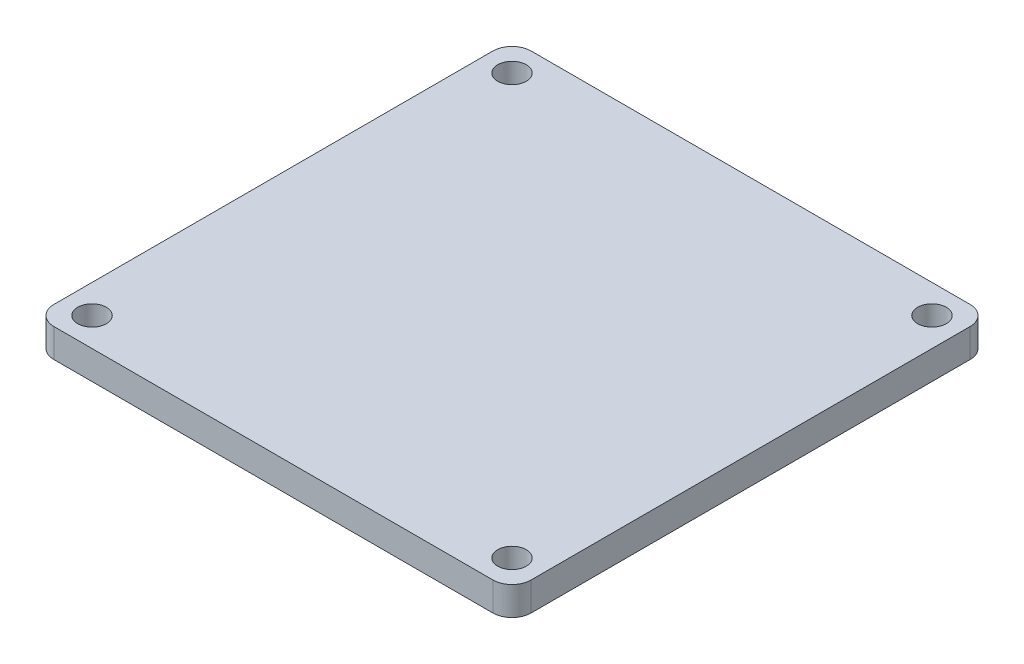
ISO-10303-21;
HEADER;
FILE_DESCRIPTION(('STEP AP214'),'2;1');
FILE_NAME('part.step','',(''),(''),'','','');
FILE_SCHEMA(('AUTOMOTIVE_DESIGN { 1 0 10303 214 1 1 1 1 }'));
ENDSEC;
DATA;
#1=APPLICATION_CONTEXT('core data for automotive mechanical design processes');
#2=APPLICATION_PROTOCOL_DEFINITION('international standard','automotive_design',2000,#1);
#3=PRODUCT_CONTEXT('',#1,'mechanical');
#4=PRODUCT('Part','Part','',(#3));
#5=PRODUCT_RELATED_PRODUCT_CATEGORY('part','',(#4));
#6=PRODUCT_DEFINITION_FORMATION('','',#4);
#7=PRODUCT_DEFINITION_CONTEXT('part definition',#1,'design');
#8=PRODUCT_DEFINITION('design','',#6,#7);
#9=PRODUCT_DEFINITION_SHAPE('','',#8);
#10=(LENGTH_UNIT() NAMED_UNIT(*) SI_UNIT(.MILLI.,.METRE.));
#11=(NAMED_UNIT(*) PLANE_ANGLE_UNIT() SI_UNIT($,.RADIAN.));
#12=(NAMED_UNIT(*) SI_UNIT($,.STERADIAN.) SOLID_ANGLE_UNIT());
#13=UNCERTAINTY_MEASURE_WITH_UNIT(LENGTH_MEASURE(1.E-05),#10,'distance_accuracy_value','');
#14=(GEOMETRIC_REPRESENTATION_CONTEXT(3) GLOBAL_UNCERTAINTY_ASSIGNED_CONTEXT((#13)) GLOBAL_UNIT_ASSIGNED_CONTEXT((#10,
#11,#12)) REPRESENTATION_CONTEXT('',''));
#15=CARTESIAN_POINT('',(0.,0.,0.));
#16=DIRECTION('',(0.,0.,1.));
#17=DIRECTION('',(1.,0.,0.));
#18=AXIS2_PLACEMENT_3D('',#15,#16,#17);
#19=CARTESIAN_POINT('',(-23.,3.,23.));
#20=DIRECTION('',(0.,-1.,0.));
#21=DIRECTION('',(0.,0.,-1.));
#22=AXIS2_PLACEMENT_3D('',#19,#20,#21);
#23=PLANE('',#22);
#24=CARTESIAN_POINT('',(-23.,3.,23.));
#25=DIRECTION('',(0.,1.,0.));
#26=DIRECTION('',(0.,0.,-1.));
#27=AXIS2_PLACEMENT_3D('',#24,#25,#26);
#28=CIRCLE('',#27,2.);
#29=CARTESIAN_POINT('',(-25.,3.,23.));
#30=VERTEX_POINT('',#29);
#31=CARTESIAN_POINT('',(-23.,3.,25.));
#32=VERTEX_POINT('',#31);
#33=EDGE_CURVE('E164',#30,#32,#28,.T.);
#34=ORIENTED_EDGE('',*,*,#33,.T.);
#35=DIRECTION('',(1.,0.,0.));
#36=VECTOR('',#35,1.);
#37=CARTESIAN_POINT('',(23.,3.,25.));
#38=LINE('',#37,#36);
#39=CARTESIAN_POINT('',(23.,3.,25.));
#40=VERTEX_POINT('',#39);
#41=EDGE_CURVE('E100',#32,#40,#38,.T.);
#42=ORIENTED_EDGE('',*,*,#41,.T.);
#43=CARTESIAN_POINT('',(23.,3.,23.));
#44=DIRECTION('',(0.,1.,0.));
#45=DIRECTION('',(0.,0.,-1.));
#46=AXIS2_PLACEMENT_3D('',#43,#44,#45);
#47=CIRCLE('',#46,2.);
#48=CARTESIAN_POINT('',(25.,3.,23.));
#49=VERTEX_POINT('',#48);
#50=EDGE_CURVE('E185',#40,#49,#47,.T.);
#51=ORIENTED_EDGE('',*,*,#50,.T.);
#52=DIRECTION('',(0.,0.,-1.));
#53=VECTOR('',#52,1.);
#54=CARTESIAN_POINT('',(25.,3.,-23.));
#55=LINE('',#54,#53);
#56=CARTESIAN_POINT('',(25.,3.,-23.));
#57=VERTEX_POINT('',#56);
#58=EDGE_CURVE('E199',#49,#57,#55,.T.);
#59=ORIENTED_EDGE('',*,*,#58,.T.);
#60=CARTESIAN_POINT('',(23.,3.,-23.));
#61=DIRECTION('',(0.,1.,0.));
#62=DIRECTION('',(0.,0.,-1.));
#63=AXIS2_PLACEMENT_3D('',#60,#61,#62);
#64=CIRCLE('',#63,2.);
#65=CARTESIAN_POINT('',(23.,3.,-25.));
#66=VERTEX_POINT('',#65);
#67=EDGE_CURVE('E119',#57,#66,#64,.T.);
#68=ORIENTED_EDGE('',*,*,#67,.T.);
#69=DIRECTION('',(-1.,0.,0.));
#70=VECTOR('',#69,1.);
#71=CARTESIAN_POINT('',(23.,3.,-25.));
#72=LINE('',#71,#70);
#73=CARTESIAN_POINT('',(-23.,3.,-25.));
#74=VERTEX_POINT('',#73);
#75=EDGE_CURVE('E113',#66,#74,#72,.T.);
#76=ORIENTED_EDGE('',*,*,#75,.T.);
#77=CARTESIAN_POINT('',(-23.,3.,-23.));
#78=DIRECTION('',(0.,1.,0.));
#79=DIRECTION('',(0.,0.,1.));
#80=AXIS2_PLACEMENT_3D('',#77,#78,#79);
#81=CIRCLE('',#80,2.);
#82=CARTESIAN_POINT('',(-25.,3.,-23.));
#83=VERTEX_POINT('',#82);
#84=EDGE_CURVE('E117',#74,#83,#81,.T.);
#85=ORIENTED_EDGE('',*,*,#84,.T.);
#86=DIRECTION('',(0.,0.,1.));
#87=VECTOR('',#86,1.);
#88=CARTESIAN_POINT('',(-25.,3.,-23.));
#89=LINE('',#88,#87);
#90=EDGE_CURVE('E57',#83,#30,#89,.T.);
#91=ORIENTED_EDGE('',*,*,#90,.T.);
#92=EDGE_LOOP('',(#34,#42,#51,#59,#68,#76,#85,#91));
#93=FACE_BOUND('',#92,.T.);
#94=CARTESIAN_POINT('',(22.,3.,-22.));
#95=DIRECTION('',(0.,1.,0.));
#96=DIRECTION('',(0.,0.,1.));
#97=AXIS2_PLACEMENT_3D('',#94,#95,#96);
#98=CIRCLE('',#97,1.5);
#99=CARTESIAN_POINT('',(22.,3.,-20.5));
#100=VERTEX_POINT('',#99);
#101=EDGE_CURVE('E146',#100,#100,#98,.T.);
#102=ORIENTED_EDGE('',*,*,#101,.F.);
#103=EDGE_LOOP('',(#102));
#104=FACE_BOUND('',#103,.T.);
#105=CARTESIAN_POINT('',(22.,3.,22.));
#106=DIRECTION('',(0.,1.,0.));
#107=DIRECTION('',(0.,0.,1.));
#108=AXIS2_PLACEMENT_3D('',#105,#106,#107);
#109=CIRCLE('',#108,1.5);
#110=CARTESIAN_POINT('',(22.,3.,23.5));
#111=VERTEX_POINT('',#110);
#112=EDGE_CURVE('E213',#111,#111,#109,.T.);
#113=ORIENTED_EDGE('',*,*,#112,.F.);
#114=EDGE_LOOP('',(#113));
#115=FACE_BOUND('',#114,.T.);
#116=CARTESIAN_POINT('',(-22.,3.,-22.));
#117=DIRECTION('',(0.,1.,0.));
#118=DIRECTION('',(0.,0.,-1.));
#119=AXIS2_PLACEMENT_3D('',#116,#117,#118);
#120=CIRCLE('',#119,1.5);
#121=CARTESIAN_POINT('',(-22.,3.,-23.5));
#122=VERTEX_POINT('',#121);
#123=EDGE_CURVE('E221',#122,#122,#120,.T.);
#124=ORIENTED_EDGE('',*,*,#123,.F.);
#125=EDGE_LOOP('',(#124));
#126=FACE_BOUND('',#125,.T.);
#127=CARTESIAN_POINT('',(-22.,3.,22.));
#128=DIRECTION('',(0.,1.,0.));
#129=DIRECTION('',(0.,0.,-1.));
#130=AXIS2_PLACEMENT_3D('',#127,#128,#129);
#131=CIRCLE('',#130,1.5);
#132=CARTESIAN_POINT('',(-22.,3.,20.5));
#133=VERTEX_POINT('',#132);
#134=EDGE_CURVE('E229',#133,#133,#131,.T.);
#135=ORIENTED_EDGE('',*,*,#134,.F.);
#136=EDGE_LOOP('',(#135));
#137=FACE_BOUND('',#136,.T.);
#138=ADVANCED_FACE('F39',(#93,#104,#115,#126,#137),#23,.F.);
#139=CARTESIAN_POINT('',(-23.,0.,23.));
#140=DIRECTION('',(0.,-1.,0.));
#141=DIRECTION('',(0.,0.,-1.));
#142=AXIS2_PLACEMENT_3D('',#139,#140,#141);
#143=PLANE('',#142);
#144=CARTESIAN_POINT('',(-22.,0.,-22.));
#145=DIRECTION('',(0.,1.,0.));
#146=DIRECTION('',(0.,0.,-1.));
#147=AXIS2_PLACEMENT_3D('',#144,#145,#146);
#148=CIRCLE('',#147,1.5);
#149=CARTESIAN_POINT('',(-22.,0.,-23.5));
#150=VERTEX_POINT('',#149);
#151=EDGE_CURVE('E225',#150,#150,#148,.T.);
#152=ORIENTED_EDGE('',*,*,#151,.T.);
#153=EDGE_LOOP('',(#152));
#154=FACE_BOUND('',#153,.T.);
#155=CARTESIAN_POINT('',(22.,0.,-22.));
#156=DIRECTION('',(0.,1.,0.));
#157=DIRECTION('',(0.,0.,1.));
#158=AXIS2_PLACEMENT_3D('',#155,#156,#157);
#159=CIRCLE('',#158,1.5);
#160=CARTESIAN_POINT('',(22.,0.,-20.5));
#161=VERTEX_POINT('',#160);
#162=EDGE_CURVE('E209',#161,#161,#159,.T.);
#163=ORIENTED_EDGE('',*,*,#162,.T.);
#164=EDGE_LOOP('',(#163));
#165=FACE_BOUND('',#164,.T.);
#166=CARTESIAN_POINT('',(-23.,0.,23.));
#167=DIRECTION('',(0.,1.,0.));
#168=DIRECTION('',(0.,0.,-1.));
#169=AXIS2_PLACEMENT_3D('',#166,#167,#168);
#170=CIRCLE('',#169,2.);
#171=CARTESIAN_POINT('',(-25.,0.,23.));
#172=VERTEX_POINT('',#171);
#173=CARTESIAN_POINT('',(-23.,0.,25.));
#174=VERTEX_POINT('',#173);
#175=EDGE_CURVE('E141',#172,#174,#170,.T.);
#176=ORIENTED_EDGE('',*,*,#175,.F.);
#177=DIRECTION('',(0.,0.,1.));
#178=VECTOR('',#177,1.);
#179=CARTESIAN_POINT('',(-25.,0.,-23.));
#180=LINE('',#179,#178);
#181=CARTESIAN_POINT('',(-25.,0.,-23.));
#182=VERTEX_POINT('',#181);
#183=EDGE_CURVE('E92',#182,#172,#180,.T.);
#184=ORIENTED_EDGE('',*,*,#183,.F.);
#185=CARTESIAN_POINT('',(-23.,0.,-23.));
#186=DIRECTION('',(0.,1.,0.));
#187=DIRECTION('',(0.,0.,1.));
#188=AXIS2_PLACEMENT_3D('',#185,#186,#187);
#189=CIRCLE('',#188,2.);
#190=CARTESIAN_POINT('',(-23.,0.,-25.));
#191=VERTEX_POINT('',#190);
#192=EDGE_CURVE('E86',#191,#182,#189,.T.);
#193=ORIENTED_EDGE('',*,*,#192,.F.);
#194=DIRECTION('',(-1.,0.,0.));
#195=VECTOR('',#194,1.);
#196=CARTESIAN_POINT('',(23.,0.,-25.));
#197=LINE('',#196,#195);
#198=CARTESIAN_POINT('',(23.,0.,-25.));
#199=VERTEX_POINT('',#198);
#200=EDGE_CURVE('E128',#199,#191,#197,.T.);
#201=ORIENTED_EDGE('',*,*,#200,.F.);
#202=CARTESIAN_POINT('',(23.,0.,-23.));
#203=DIRECTION('',(0.,1.,0.));
#204=DIRECTION('',(0.,0.,-1.));
#205=AXIS2_PLACEMENT_3D('',#202,#203,#204);
#206=CIRCLE('',#205,2.);
#207=CARTESIAN_POINT('',(25.,0.,-23.));
#208=VERTEX_POINT('',#207);
#209=EDGE_CURVE('E155',#208,#199,#206,.T.);
#210=ORIENTED_EDGE('',*,*,#209,.F.);
#211=DIRECTION('',(0.,0.,-1.));
#212=VECTOR('',#211,1.);
#213=CARTESIAN_POINT('',(25.,0.,-23.));
#214=LINE('',#213,#212);
#215=CARTESIAN_POINT('',(25.,0.,23.));
#216=VERTEX_POINT('',#215);
#217=EDGE_CURVE('E152',#216,#208,#214,.T.);
#218=ORIENTED_EDGE('',*,*,#217,.F.);
#219=CARTESIAN_POINT('',(23.,0.,23.));
#220=DIRECTION('',(0.,1.,0.));
#221=DIRECTION('',(0.,0.,-1.));
#222=AXIS2_PLACEMENT_3D('',#219,#220,#221);
#223=CIRCLE('',#222,2.);
#224=CARTESIAN_POINT('',(23.,0.,25.));
#225=VERTEX_POINT('',#224);
#226=EDGE_CURVE('E149',#225,#216,#223,.T.);
#227=ORIENTED_EDGE('',*,*,#226,.F.);
#228=DIRECTION('',(1.,0.,0.));
#229=VECTOR('',#228,1.);
#230=CARTESIAN_POINT('',(23.,0.,25.));
#231=LINE('',#230,#229);
#232=EDGE_CURVE('E145',#174,#225,#231,.T.);
#233=ORIENTED_EDGE('',*,*,#232,.F.);
#234=EDGE_LOOP('',(#176,#184,#193,#201,#210,#218,#227,#233));
#235=FACE_BOUND('',#234,.T.);
#236=CARTESIAN_POINT('',(22.,0.,22.));
#237=DIRECTION('',(0.,1.,0.));
#238=DIRECTION('',(0.,0.,1.));
#239=AXIS2_PLACEMENT_3D('',#236,#237,#238);
#240=CIRCLE('',#239,1.5);
#241=CARTESIAN_POINT('',(22.,0.,23.5));
#242=VERTEX_POINT('',#241);
#243=EDGE_CURVE('E217',#242,#242,#240,.T.);
#244=ORIENTED_EDGE('',*,*,#243,.T.);
#245=EDGE_LOOP('',(#244));
#246=FACE_BOUND('',#245,.T.);
#247=CARTESIAN_POINT('',(-22.,0.,22.));
#248=DIRECTION('',(0.,1.,0.));
#249=DIRECTION('',(0.,0.,-1.));
#250=AXIS2_PLACEMENT_3D('',#247,#248,#249);
#251=CIRCLE('',#250,1.5);
#252=CARTESIAN_POINT('',(-22.,0.,20.5));
#253=VERTEX_POINT('',#252);
#254=EDGE_CURVE('E233',#253,#253,#251,.T.);
#255=ORIENTED_EDGE('',*,*,#254,.T.);
#256=EDGE_LOOP('',(#255));
#257=FACE_BOUND('',#256,.T.);
#258=ADVANCED_FACE('F189',(#154,#165,#235,#246,#257),#143,.T.);
#259=CARTESIAN_POINT('',(-23.,3.,23.));
#260=DIRECTION('',(0.,-1.,0.));
#261=DIRECTION('',(0.,0.,-1.));
#262=AXIS2_PLACEMENT_3D('',#259,#260,#261);
#263=CYLINDRICAL_SURFACE('',#262,2.);
#264=ORIENTED_EDGE('',*,*,#175,.T.);
#265=DIRECTION('',(0.,-1.,0.));
#266=VECTOR('',#265,1.);
#267=CARTESIAN_POINT('',(-23.,3.,25.));
#268=LINE('',#267,#266);
#269=EDGE_CURVE('E11',#32,#174,#268,.T.);
#270=ORIENTED_EDGE('',*,*,#269,.F.);
#271=ORIENTED_EDGE('',*,*,#33,.F.);
#272=DIRECTION('',(0.,-1.,0.));
#273=VECTOR('',#272,1.);
#274=CARTESIAN_POINT('',(-25.,3.,23.));
#275=LINE('',#274,#273);
#276=EDGE_CURVE('E137',#30,#172,#275,.T.);
#277=ORIENTED_EDGE('',*,*,#276,.T.);
#278=EDGE_LOOP('',(#264,#270,#271,#277));
#279=FACE_BOUND('',#278,.T.);
#280=ADVANCED_FACE('F41',(#279),#263,.T.);
#281=CARTESIAN_POINT('',(23.,3.,25.));
#282=DIRECTION('',(0.,0.,-1.));
#283=DIRECTION('',(-1.,0.,0.));
#284=AXIS2_PLACEMENT_3D('',#281,#282,#283);
#285=PLANE('',#284);
#286=ORIENTED_EDGE('',*,*,#232,.T.);
#287=DIRECTION('',(0.,-1.,0.));
#288=VECTOR('',#287,1.);
#289=CARTESIAN_POINT('',(23.,3.,25.));
#290=LINE('',#289,#288);
#291=EDGE_CURVE('E49',#40,#225,#290,.T.);
#292=ORIENTED_EDGE('',*,*,#291,.F.);
#293=ORIENTED_EDGE('',*,*,#41,.F.);
#294=ORIENTED_EDGE('',*,*,#269,.T.);
#295=EDGE_LOOP('',(#286,#292,#293,#294));
#296=FACE_BOUND('',#295,.T.);
#297=ADVANCED_FACE('F267',(#296),#285,.F.);
#298=CARTESIAN_POINT('',(23.,3.,23.));
#299=DIRECTION('',(0.,-1.,0.));
#300=DIRECTION('',(0.,0.,-1.));
#301=AXIS2_PLACEMENT_3D('',#298,#299,#300);
#302=CYLINDRICAL_SURFACE('',#301,2.);
#303=ORIENTED_EDGE('',*,*,#226,.T.);
#304=DIRECTION('',(0.,-1.,0.));
#305=VECTOR('',#304,1.);
#306=CARTESIAN_POINT('',(25.,3.,23.));
#307=LINE('',#306,#305);
#308=EDGE_CURVE('E175',#49,#216,#307,.T.);
#309=ORIENTED_EDGE('',*,*,#308,.F.);
#310=ORIENTED_EDGE('',*,*,#50,.F.);
#311=ORIENTED_EDGE('',*,*,#291,.T.);
#312=EDGE_LOOP('',(#303,#309,#310,#311));
#313=FACE_BOUND('',#312,.T.);
#314=ADVANCED_FACE('F183',(#313),#302,.T.);
#315=CARTESIAN_POINT('',(25.,3.,-23.));
#316=DIRECTION('',(-1.,0.,0.));
#317=DIRECTION('',(0.,0.,1.));
#318=AXIS2_PLACEMENT_3D('',#315,#316,#317);
#319=PLANE('',#318);
#320=ORIENTED_EDGE('',*,*,#217,.T.);
#321=DIRECTION('',(0.,-1.,0.));
#322=VECTOR('',#321,1.);
#323=CARTESIAN_POINT('',(25.,3.,-23.));
#324=LINE('',#323,#322);
#325=EDGE_CURVE('E171',#57,#208,#324,.T.);
#326=ORIENTED_EDGE('',*,*,#325,.F.);
#327=ORIENTED_EDGE('',*,*,#58,.F.);
#328=ORIENTED_EDGE('',*,*,#308,.T.);
#329=EDGE_LOOP('',(#320,#326,#327,#328));
#330=FACE_BOUND('',#329,.T.);
#331=ADVANCED_FACE('F194',(#330),#319,.F.);
#332=CARTESIAN_POINT('',(23.,3.,-23.));
#333=DIRECTION('',(0.,-1.,0.));
#334=DIRECTION('',(0.,0.,-1.));
#335=AXIS2_PLACEMENT_3D('',#332,#333,#334);
#336=CYLINDRICAL_SURFACE('',#335,2.);
#337=ORIENTED_EDGE('',*,*,#209,.T.);
#338=DIRECTION('',(0.,-1.,0.));
#339=VECTOR('',#338,1.);
#340=CARTESIAN_POINT('',(23.,3.,-25.));
#341=LINE('',#340,#339);
#342=EDGE_CURVE('E130',#66,#199,#341,.T.);
#343=ORIENTED_EDGE('',*,*,#342,.F.);
#344=ORIENTED_EDGE('',*,*,#67,.F.);
#345=ORIENTED_EDGE('',*,*,#325,.T.);
#346=EDGE_LOOP('',(#337,#343,#344,#345));
#347=FACE_BOUND('',#346,.T.);
#348=ADVANCED_FACE('F197',(#347),#336,.T.);
#349=CARTESIAN_POINT('',(23.,3.,-25.));
#350=DIRECTION('',(0.,0.,1.));
#351=DIRECTION('',(1.,0.,0.));
#352=AXIS2_PLACEMENT_3D('',#349,#350,#351);
#353=PLANE('',#352);
#354=ORIENTED_EDGE('',*,*,#200,.T.);
#355=DIRECTION('',(0.,-1.,0.));
#356=VECTOR('',#355,1.);
#357=CARTESIAN_POINT('',(-23.,3.,-25.));
#358=LINE('',#357,#356);
#359=EDGE_CURVE('E125',#74,#191,#358,.T.);
#360=ORIENTED_EDGE('',*,*,#359,.F.);
#361=ORIENTED_EDGE('',*,*,#75,.F.);
#362=ORIENTED_EDGE('',*,*,#342,.T.);
#363=EDGE_LOOP('',(#354,#360,#361,#362));
#364=FACE_BOUND('',#363,.T.);
#365=ADVANCED_FACE('F126',(#364),#353,.F.);
#366=CARTESIAN_POINT('',(-23.,3.,-23.));
#367=DIRECTION('',(0.,-1.,0.));
#368=DIRECTION('',(0.,0.,-1.));
#369=AXIS2_PLACEMENT_3D('',#366,#367,#368);
#370=CYLINDRICAL_SURFACE('',#369,2.);
#371=ORIENTED_EDGE('',*,*,#192,.T.);
#372=DIRECTION('',(0.,-1.,0.));
#373=VECTOR('',#372,1.);
#374=CARTESIAN_POINT('',(-25.,3.,-23.));
#375=LINE('',#374,#373);
#376=EDGE_CURVE('E131',#83,#182,#375,.T.);
#377=ORIENTED_EDGE('',*,*,#376,.F.);
#378=ORIENTED_EDGE('',*,*,#84,.F.);
#379=ORIENTED_EDGE('',*,*,#359,.T.);
#380=EDGE_LOOP('',(#371,#377,#378,#379));
#381=FACE_BOUND('',#380,.T.);
#382=ADVANCED_FACE('F133',(#381),#370,.T.);
#383=CARTESIAN_POINT('',(-25.,3.,-23.));
#384=DIRECTION('',(1.,0.,0.));
#385=DIRECTION('',(0.,0.,-1.));
#386=AXIS2_PLACEMENT_3D('',#383,#384,#385);
#387=PLANE('',#386);
#388=ORIENTED_EDGE('',*,*,#183,.T.);
#389=ORIENTED_EDGE('',*,*,#276,.F.);
#390=ORIENTED_EDGE('',*,*,#90,.F.);
#391=ORIENTED_EDGE('',*,*,#376,.T.);
#392=EDGE_LOOP('',(#388,#389,#390,#391));
#393=FACE_BOUND('',#392,.T.);
#394=ADVANCED_FACE('F255',(#393),#387,.F.);
#395=CARTESIAN_POINT('',(22.,3.,-22.));
#396=DIRECTION('',(0.,-1.,0.));
#397=DIRECTION('',(0.,0.,-1.));
#398=AXIS2_PLACEMENT_3D('',#395,#396,#397);
#399=CYLINDRICAL_SURFACE('',#398,1.5);
#400=ORIENTED_EDGE('',*,*,#101,.T.);
#401=EDGE_LOOP('',(#400));
#402=FACE_BOUND('',#401,.T.);
#403=ORIENTED_EDGE('',*,*,#162,.F.);
#404=EDGE_LOOP('',(#403));
#405=FACE_BOUND('',#404,.T.);
#406=ADVANCED_FACE('F252',(#402,#405),#399,.F.);
#407=CARTESIAN_POINT('',(22.,3.,22.));
#408=DIRECTION('',(0.,-1.,0.));
#409=DIRECTION('',(0.,0.,-1.));
#410=AXIS2_PLACEMENT_3D('',#407,#408,#409);
#411=CYLINDRICAL_SURFACE('',#410,1.5);
#412=ORIENTED_EDGE('',*,*,#112,.T.);
#413=EDGE_LOOP('',(#412));
#414=FACE_BOUND('',#413,.T.);
#415=ORIENTED_EDGE('',*,*,#243,.F.);
#416=EDGE_LOOP('',(#415));
#417=FACE_BOUND('',#416,.T.);
#418=ADVANCED_FACE('F331',(#414,#417),#411,.F.);
#419=CARTESIAN_POINT('',(-22.,3.,-22.));
#420=DIRECTION('',(0.,-1.,0.));
#421=DIRECTION('',(0.,0.,-1.));
#422=AXIS2_PLACEMENT_3D('',#419,#420,#421);
#423=CYLINDRICAL_SURFACE('',#422,1.5);
#424=ORIENTED_EDGE('',*,*,#123,.T.);
#425=EDGE_LOOP('',(#424));
#426=FACE_BOUND('',#425,.T.);
#427=ORIENTED_EDGE('',*,*,#151,.F.);
#428=EDGE_LOOP('',(#427));
#429=FACE_BOUND('',#428,.T.);
#430=ADVANCED_FACE('F339',(#426,#429),#423,.F.);
#431=CARTESIAN_POINT('',(-22.,3.,22.));
#432=DIRECTION('',(0.,-1.,0.));
#433=DIRECTION('',(0.,0.,-1.));
#434=AXIS2_PLACEMENT_3D('',#431,#432,#433);
#435=CYLINDRICAL_SURFACE('',#434,1.5);
#436=ORIENTED_EDGE('',*,*,#134,.T.);
#437=EDGE_LOOP('',(#436));
#438=FACE_BOUND('',#437,.T.);
#439=ORIENTED_EDGE('',*,*,#254,.F.);
#440=EDGE_LOOP('',(#439));
#441=FACE_BOUND('',#440,.T.);
#442=ADVANCED_FACE('F241',(#438,#441),#435,.F.);
#443=CLOSED_SHELL('',(#138,#258,#280,#297,#314,#331,#348,#365,#382,#394,#406,#418,#430,#442));
#444=MANIFOLD_SOLID_BREP('B2',#443);
#445=ADVANCED_BREP_SHAPE_REPRESENTATION('',(#18,#444),#14);
#446=SHAPE_DEFINITION_REPRESENTATION(#9,#445);
ENDSEC;
END-ISO-10303-21;
